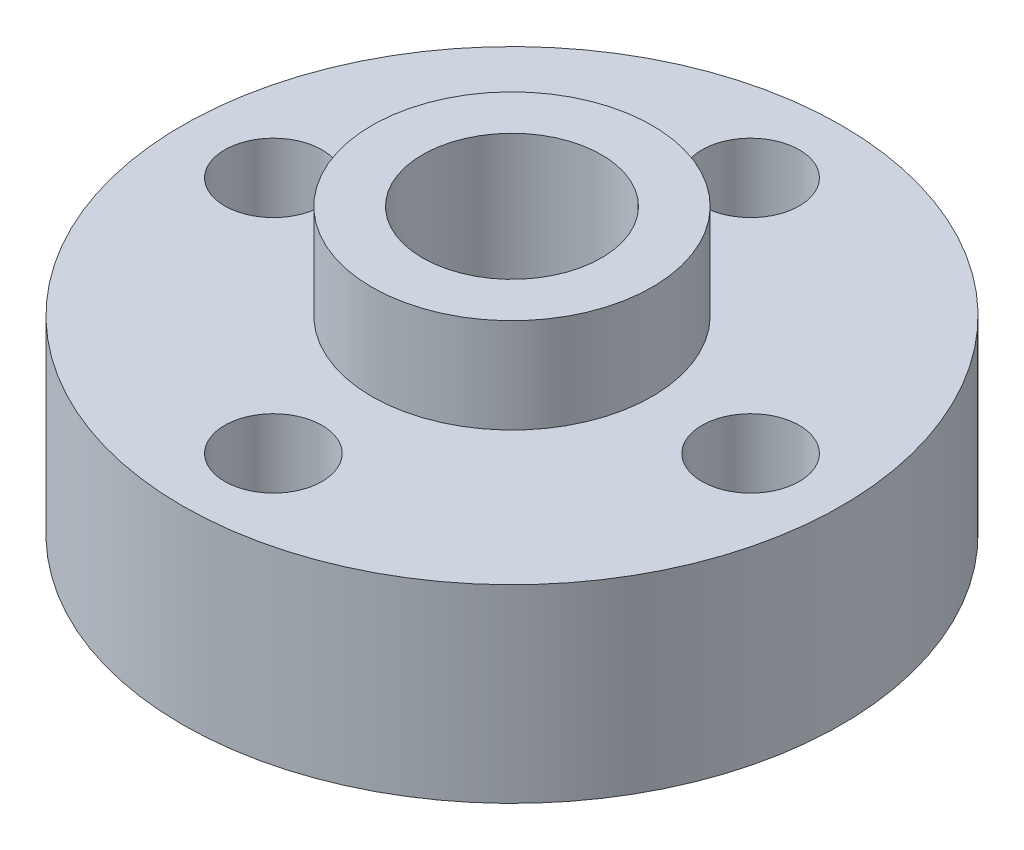
ISO-10303-21;
HEADER;
FILE_DESCRIPTION(('STEP AP214'),'2;1');
FILE_NAME('part.step','',(''),(''),'','','');
FILE_SCHEMA(('AUTOMOTIVE_DESIGN { 1 0 10303 214 1 1 1 1 }'));
ENDSEC;
DATA;
#1=APPLICATION_CONTEXT('core data for automotive mechanical design processes');
#2=APPLICATION_PROTOCOL_DEFINITION('international standard','automotive_design',2000,#1);
#3=PRODUCT_CONTEXT('',#1,'mechanical');
#4=PRODUCT('Part','Part','',(#3));
#5=PRODUCT_RELATED_PRODUCT_CATEGORY('part','',(#4));
#6=PRODUCT_DEFINITION_FORMATION('','',#4);
#7=PRODUCT_DEFINITION_CONTEXT('part definition',#1,'design');
#8=PRODUCT_DEFINITION('design','',#6,#7);
#9=PRODUCT_DEFINITION_SHAPE('','',#8);
#10=(LENGTH_UNIT() NAMED_UNIT(*) SI_UNIT(.MILLI.,.METRE.));
#11=(NAMED_UNIT(*) PLANE_ANGLE_UNIT() SI_UNIT($,.RADIAN.));
#12=(NAMED_UNIT(*) SI_UNIT($,.STERADIAN.) SOLID_ANGLE_UNIT());
#13=UNCERTAINTY_MEASURE_WITH_UNIT(LENGTH_MEASURE(1.E-05),#10,'distance_accuracy_value','');
#14=(GEOMETRIC_REPRESENTATION_CONTEXT(3) GLOBAL_UNCERTAINTY_ASSIGNED_CONTEXT((#13)) GLOBAL_UNIT_ASSIGNED_CONTEXT((#10,
#11,#12)) REPRESENTATION_CONTEXT('',''));
#15=CARTESIAN_POINT('',(0.,0.,0.));
#16=DIRECTION('',(0.,0.,1.));
#17=DIRECTION('',(1.,0.,0.));
#18=AXIS2_PLACEMENT_3D('',#15,#16,#17);
#19=CARTESIAN_POINT('',(0.,6.35,0.));
#20=DIRECTION('',(0.,-1.,0.));
#21=DIRECTION('',(0.,0.,-1.));
#22=AXIS2_PLACEMENT_3D('',#19,#20,#21);
#23=CYLINDRICAL_SURFACE('',#22,4.699);
#24=CARTESIAN_POINT('',(0.,-6.35,0.));
#25=DIRECTION('',(0.,1.,0.));
#26=DIRECTION('',(0.,0.,1.));
#27=AXIS2_PLACEMENT_3D('',#24,#25,#26);
#28=CIRCLE('',#27,4.699);
#29=CARTESIAN_POINT('',(0.,-6.35,4.699));
#30=VERTEX_POINT('',#29);
#31=EDGE_CURVE('E55',#30,#30,#28,.T.);
#32=ORIENTED_EDGE('',*,*,#31,.T.);
#33=EDGE_LOOP('',(#32));
#34=FACE_BOUND('',#33,.T.);
#35=CARTESIAN_POINT('',(0.,-3.175,0.));
#36=DIRECTION('',(0.,1.,0.));
#37=DIRECTION('',(0.,0.,1.));
#38=AXIS2_PLACEMENT_3D('',#35,#36,#37);
#39=CIRCLE('',#38,4.699);
#40=CARTESIAN_POINT('',(0.,-3.175,4.699));
#41=VERTEX_POINT('',#40);
#42=EDGE_CURVE('E10',#41,#41,#39,.T.);
#43=ORIENTED_EDGE('',*,*,#42,.F.);
#44=EDGE_LOOP('',(#43));
#45=FACE_BOUND('',#44,.T.);
#46=ADVANCED_FACE('F35',(#34,#45),#23,.T.);
#47=CARTESIAN_POINT('',(0.,3.175,0.));
#48=DIRECTION('',(0.,1.,0.));
#49=DIRECTION('',(0.,0.,1.));
#50=AXIS2_PLACEMENT_3D('',#47,#48,#49);
#51=CIRCLE('',#50,4.699);
#52=CARTESIAN_POINT('',(0.,3.175,4.699));
#53=VERTEX_POINT('',#52);
#54=EDGE_CURVE('E133',#53,#53,#51,.T.);
#55=ORIENTED_EDGE('',*,*,#54,.T.);
#56=EDGE_LOOP('',(#55));
#57=FACE_BOUND('',#56,.T.);
#58=CARTESIAN_POINT('',(0.,6.35,0.));
#59=DIRECTION('',(0.,1.,0.));
#60=DIRECTION('',(0.,0.,1.));
#61=AXIS2_PLACEMENT_3D('',#58,#59,#60);
#62=CIRCLE('',#61,4.699);
#63=CARTESIAN_POINT('',(0.,6.35,4.699));
#64=VERTEX_POINT('',#63);
#65=EDGE_CURVE('E46',#64,#64,#62,.T.);
#66=ORIENTED_EDGE('',*,*,#65,.F.);
#67=EDGE_LOOP('',(#66));
#68=FACE_BOUND('',#67,.T.);
#69=ADVANCED_FACE('F37',(#57,#68),#23,.T.);
#70=CARTESIAN_POINT('',(0.,6.35,0.));
#71=DIRECTION('',(0.,-1.,0.));
#72=DIRECTION('',(0.,0.,-1.));
#73=AXIS2_PLACEMENT_3D('',#70,#71,#72);
#74=CYLINDRICAL_SURFACE('',#73,3.);
#75=CARTESIAN_POINT('',(0.,6.35,0.));
#76=DIRECTION('',(0.,1.,0.));
#77=DIRECTION('',(0.,0.,1.));
#78=AXIS2_PLACEMENT_3D('',#75,#76,#77);
#79=CIRCLE('',#78,3.);
#80=CARTESIAN_POINT('',(0.,6.35,3.));
#81=VERTEX_POINT('',#80);
#82=EDGE_CURVE('E42',#81,#81,#79,.T.);
#83=ORIENTED_EDGE('',*,*,#82,.T.);
#84=EDGE_LOOP('',(#83));
#85=FACE_BOUND('',#84,.T.);
#86=CARTESIAN_POINT('',(0.,-6.35,0.));
#87=DIRECTION('',(0.,1.,0.));
#88=DIRECTION('',(0.,0.,1.));
#89=AXIS2_PLACEMENT_3D('',#86,#87,#88);
#90=CIRCLE('',#89,3.);
#91=CARTESIAN_POINT('',(0.,-6.35,3.));
#92=VERTEX_POINT('',#91);
#93=EDGE_CURVE('E51',#92,#92,#90,.T.);
#94=ORIENTED_EDGE('',*,*,#93,.F.);
#95=EDGE_LOOP('',(#94));
#96=FACE_BOUND('',#95,.T.);
#97=ADVANCED_FACE('F63',(#85,#96),#74,.F.);
#98=CARTESIAN_POINT('',(0.,6.35,0.));
#99=DIRECTION('',(0.,1.,0.));
#100=DIRECTION('',(0.,0.,1.));
#101=AXIS2_PLACEMENT_3D('',#98,#99,#100);
#102=PLANE('',#101);
#103=ORIENTED_EDGE('',*,*,#65,.T.);
#104=EDGE_LOOP('',(#103));
#105=FACE_BOUND('',#104,.T.);
#106=ORIENTED_EDGE('',*,*,#82,.F.);
#107=EDGE_LOOP('',(#106));
#108=FACE_BOUND('',#107,.T.);
#109=ADVANCED_FACE('F65',(#105,#108),#102,.T.);
#110=CARTESIAN_POINT('',(0.,-6.35,0.));
#111=DIRECTION('',(0.,1.,0.));
#112=DIRECTION('',(0.,0.,1.));
#113=AXIS2_PLACEMENT_3D('',#110,#111,#112);
#114=PLANE('',#113);
#115=ORIENTED_EDGE('',*,*,#31,.F.);
#116=EDGE_LOOP('',(#115));
#117=FACE_BOUND('',#116,.T.);
#118=ORIENTED_EDGE('',*,*,#93,.T.);
#119=EDGE_LOOP('',(#118));
#120=FACE_BOUND('',#119,.T.);
#121=ADVANCED_FACE('F61',(#117,#120),#114,.F.);
#122=CARTESIAN_POINT('',(8.00000000000022,3.175,-2.24629082228256E-13));
#123=DIRECTION('',(0.,-1.,0.));
#124=DIRECTION('',(0.,0.,-1.));
#125=AXIS2_PLACEMENT_3D('',#122,#123,#124);
#126=CYLINDRICAL_SURFACE('',#125,1.63195);
#127=CARTESIAN_POINT('',(8.00000000000022,3.175,-2.24629082228256E-13));
#128=DIRECTION('',(0.,1.,0.));
#129=DIRECTION('',(0.,0.,1.));
#130=AXIS2_PLACEMENT_3D('',#127,#128,#129);
#131=CIRCLE('',#130,1.63195);
#132=CARTESIAN_POINT('',(8.00000000000022,3.175,1.63194999999978));
#133=VERTEX_POINT('',#132);
#134=EDGE_CURVE('E129',#133,#133,#131,.T.);
#135=ORIENTED_EDGE('',*,*,#134,.T.);
#136=EDGE_LOOP('',(#135));
#137=FACE_BOUND('',#136,.T.);
#138=CARTESIAN_POINT('',(8.00000000000022,-3.175,-2.24629082228256E-13));
#139=DIRECTION('',(0.,1.,0.));
#140=DIRECTION('',(0.,0.,1.));
#141=AXIS2_PLACEMENT_3D('',#138,#139,#140);
#142=CIRCLE('',#141,1.63195);
#143=CARTESIAN_POINT('',(8.00000000000022,-3.175,1.63194999999978));
#144=VERTEX_POINT('',#143);
#145=EDGE_CURVE('E149',#144,#144,#142,.T.);
#146=ORIENTED_EDGE('',*,*,#145,.F.);
#147=EDGE_LOOP('',(#146));
#148=FACE_BOUND('',#147,.T.);
#149=ADVANCED_FACE('F82',(#137,#148),#126,.F.);
#150=CARTESIAN_POINT('',(4.49258164456512E-13,3.175,8.));
#151=DIRECTION('',(0.,-1.,0.));
#152=DIRECTION('',(0.,0.,-1.));
#153=AXIS2_PLACEMENT_3D('',#150,#151,#152);
#154=CYLINDRICAL_SURFACE('',#153,1.63195);
#155=CARTESIAN_POINT('',(4.49258164456512E-13,3.175,8.));
#156=DIRECTION('',(0.,1.,0.));
#157=DIRECTION('',(0.,0.,1.));
#158=AXIS2_PLACEMENT_3D('',#155,#156,#157);
#159=CIRCLE('',#158,1.63195);
#160=CARTESIAN_POINT('',(4.49258164456512E-13,3.175,9.63195));
#161=VERTEX_POINT('',#160);
#162=EDGE_CURVE('E125',#161,#161,#159,.T.);
#163=ORIENTED_EDGE('',*,*,#162,.T.);
#164=EDGE_LOOP('',(#163));
#165=FACE_BOUND('',#164,.T.);
#166=CARTESIAN_POINT('',(4.49258164456512E-13,-3.175,8.));
#167=DIRECTION('',(0.,1.,0.));
#168=DIRECTION('',(0.,0.,1.));
#169=AXIS2_PLACEMENT_3D('',#166,#167,#168);
#170=CIRCLE('',#169,1.63195);
#171=CARTESIAN_POINT('',(4.49258164456512E-13,-3.175,9.63195));
#172=VERTEX_POINT('',#171);
#173=EDGE_CURVE('E146',#172,#172,#170,.T.);
#174=ORIENTED_EDGE('',*,*,#173,.F.);
#175=EDGE_LOOP('',(#174));
#176=FACE_BOUND('',#175,.T.);
#177=ADVANCED_FACE('F86',(#165,#176),#154,.F.);
#178=CARTESIAN_POINT('',(-7.99999999999978,3.175,2.25608799667574E-13));
#179=DIRECTION('',(0.,-1.,0.));
#180=DIRECTION('',(0.,0.,-1.));
#181=AXIS2_PLACEMENT_3D('',#178,#179,#180);
#182=CYLINDRICAL_SURFACE('',#181,1.63195);
#183=CARTESIAN_POINT('',(-7.99999999999978,3.175,2.25608799667574E-13));
#184=DIRECTION('',(0.,1.,0.));
#185=DIRECTION('',(0.,0.,1.));
#186=AXIS2_PLACEMENT_3D('',#183,#184,#185);
#187=CIRCLE('',#186,1.63195);
#188=CARTESIAN_POINT('',(-7.99999999999978,3.175,1.63195000000023));
#189=VERTEX_POINT('',#188);
#190=EDGE_CURVE('E121',#189,#189,#187,.T.);
#191=ORIENTED_EDGE('',*,*,#190,.T.);
#192=EDGE_LOOP('',(#191));
#193=FACE_BOUND('',#192,.T.);
#194=CARTESIAN_POINT('',(-7.99999999999978,-3.175,2.25608799667574E-13));
#195=DIRECTION('',(0.,1.,0.));
#196=DIRECTION('',(0.,0.,1.));
#197=AXIS2_PLACEMENT_3D('',#194,#195,#196);
#198=CIRCLE('',#197,1.63195);
#199=CARTESIAN_POINT('',(-7.99999999999978,-3.175,1.63195000000023));
#200=VERTEX_POINT('',#199);
#201=EDGE_CURVE('E143',#200,#200,#198,.T.);
#202=ORIENTED_EDGE('',*,*,#201,.F.);
#203=EDGE_LOOP('',(#202));
#204=FACE_BOUND('',#203,.T.);
#205=ADVANCED_FACE('F94',(#193,#204),#182,.F.);
#206=CARTESIAN_POINT('',(0.,3.175,-8.));
#207=DIRECTION('',(0.,-1.,0.));
#208=DIRECTION('',(0.,0.,-1.));
#209=AXIS2_PLACEMENT_3D('',#206,#207,#208);
#210=CYLINDRICAL_SURFACE('',#209,1.63195);
#211=CARTESIAN_POINT('',(0.,3.175,-8.));
#212=DIRECTION('',(0.,1.,0.));
#213=DIRECTION('',(0.,0.,1.));
#214=AXIS2_PLACEMENT_3D('',#211,#212,#213);
#215=CIRCLE('',#214,1.63195);
#216=CARTESIAN_POINT('',(0.,3.175,-6.36805));
#217=VERTEX_POINT('',#216);
#218=EDGE_CURVE('E117',#217,#217,#215,.T.);
#219=ORIENTED_EDGE('',*,*,#218,.T.);
#220=EDGE_LOOP('',(#219));
#221=FACE_BOUND('',#220,.T.);
#222=CARTESIAN_POINT('',(0.,-3.175,-8.));
#223=DIRECTION('',(0.,1.,0.));
#224=DIRECTION('',(0.,0.,1.));
#225=AXIS2_PLACEMENT_3D('',#222,#223,#224);
#226=CIRCLE('',#225,1.63195);
#227=CARTESIAN_POINT('',(0.,-3.175,-6.36805));
#228=VERTEX_POINT('',#227);
#229=EDGE_CURVE('E140',#228,#228,#226,.T.);
#230=ORIENTED_EDGE('',*,*,#229,.F.);
#231=EDGE_LOOP('',(#230));
#232=FACE_BOUND('',#231,.T.);
#233=ADVANCED_FACE('F90',(#221,#232),#210,.F.);
#234=CARTESIAN_POINT('',(0.,3.175,0.));
#235=DIRECTION('',(0.,-1.,0.));
#236=DIRECTION('',(0.,0.,-1.));
#237=AXIS2_PLACEMENT_3D('',#234,#235,#236);
#238=CYLINDRICAL_SURFACE('',#237,11.049);
#239=CARTESIAN_POINT('',(0.,3.175,0.));
#240=DIRECTION('',(0.,1.,0.));
#241=DIRECTION('',(0.,0.,1.));
#242=AXIS2_PLACEMENT_3D('',#239,#240,#241);
#243=CIRCLE('',#242,11.049);
#244=CARTESIAN_POINT('',(0.,3.175,11.049));
#245=VERTEX_POINT('',#244);
#246=EDGE_CURVE('E57',#245,#245,#243,.T.);
#247=ORIENTED_EDGE('',*,*,#246,.F.);
#248=EDGE_LOOP('',(#247));
#249=FACE_BOUND('',#248,.T.);
#250=CARTESIAN_POINT('',(0.,-3.175,0.));
#251=DIRECTION('',(0.,1.,0.));
#252=DIRECTION('',(0.,0.,1.));
#253=AXIS2_PLACEMENT_3D('',#250,#251,#252);
#254=CIRCLE('',#253,11.049);
#255=CARTESIAN_POINT('',(0.,-3.175,11.049));
#256=VERTEX_POINT('',#255);
#257=EDGE_CURVE('E151',#256,#256,#254,.T.);
#258=ORIENTED_EDGE('',*,*,#257,.T.);
#259=EDGE_LOOP('',(#258));
#260=FACE_BOUND('',#259,.T.);
#261=ADVANCED_FACE('F93',(#249,#260),#238,.T.);
#262=CARTESIAN_POINT('',(0.,3.175,0.));
#263=DIRECTION('',(0.,1.,0.));
#264=DIRECTION('',(0.,0.,1.));
#265=AXIS2_PLACEMENT_3D('',#262,#263,#264);
#266=PLANE('',#265);
#267=ORIENTED_EDGE('',*,*,#218,.F.);
#268=EDGE_LOOP('',(#267));
#269=FACE_BOUND('',#268,.T.);
#270=ORIENTED_EDGE('',*,*,#190,.F.);
#271=EDGE_LOOP('',(#270));
#272=FACE_BOUND('',#271,.T.);
#273=ORIENTED_EDGE('',*,*,#162,.F.);
#274=EDGE_LOOP('',(#273));
#275=FACE_BOUND('',#274,.T.);
#276=ORIENTED_EDGE('',*,*,#134,.F.);
#277=EDGE_LOOP('',(#276));
#278=FACE_BOUND('',#277,.T.);
#279=ORIENTED_EDGE('',*,*,#54,.F.);
#280=EDGE_LOOP('',(#279));
#281=FACE_BOUND('',#280,.T.);
#282=ORIENTED_EDGE('',*,*,#246,.T.);
#283=EDGE_LOOP('',(#282));
#284=FACE_BOUND('',#283,.T.);
#285=ADVANCED_FACE('F104',(#269,#272,#275,#278,#281,#284),#266,.T.);
#286=CARTESIAN_POINT('',(0.,-3.175,0.));
#287=DIRECTION('',(0.,1.,0.));
#288=DIRECTION('',(0.,0.,1.));
#289=AXIS2_PLACEMENT_3D('',#286,#287,#288);
#290=PLANE('',#289);
#291=ORIENTED_EDGE('',*,*,#229,.T.);
#292=EDGE_LOOP('',(#291));
#293=FACE_BOUND('',#292,.T.);
#294=ORIENTED_EDGE('',*,*,#201,.T.);
#295=EDGE_LOOP('',(#294));
#296=FACE_BOUND('',#295,.T.);
#297=ORIENTED_EDGE('',*,*,#173,.T.);
#298=EDGE_LOOP('',(#297));
#299=FACE_BOUND('',#298,.T.);
#300=ORIENTED_EDGE('',*,*,#145,.T.);
#301=EDGE_LOOP('',(#300));
#302=FACE_BOUND('',#301,.T.);
#303=ORIENTED_EDGE('',*,*,#42,.T.);
#304=EDGE_LOOP('',(#303));
#305=FACE_BOUND('',#304,.T.);
#306=ORIENTED_EDGE('',*,*,#257,.F.);
#307=EDGE_LOOP('',(#306));
#308=FACE_BOUND('',#307,.T.);
#309=ADVANCED_FACE('F106',(#293,#296,#299,#302,#305,#308),#290,.F.);
#310=CLOSED_SHELL('',(#46,#69,#97,#109,#121,#149,#177,#205,#233,#261,#285,#309));
#311=MANIFOLD_SOLID_BREP('B2',#310);
#312=ADVANCED_BREP_SHAPE_REPRESENTATION('',(#18,#311),#14);
#313=SHAPE_DEFINITION_REPRESENTATION(#9,#312);
ENDSEC;
END-ISO-10303-21;
